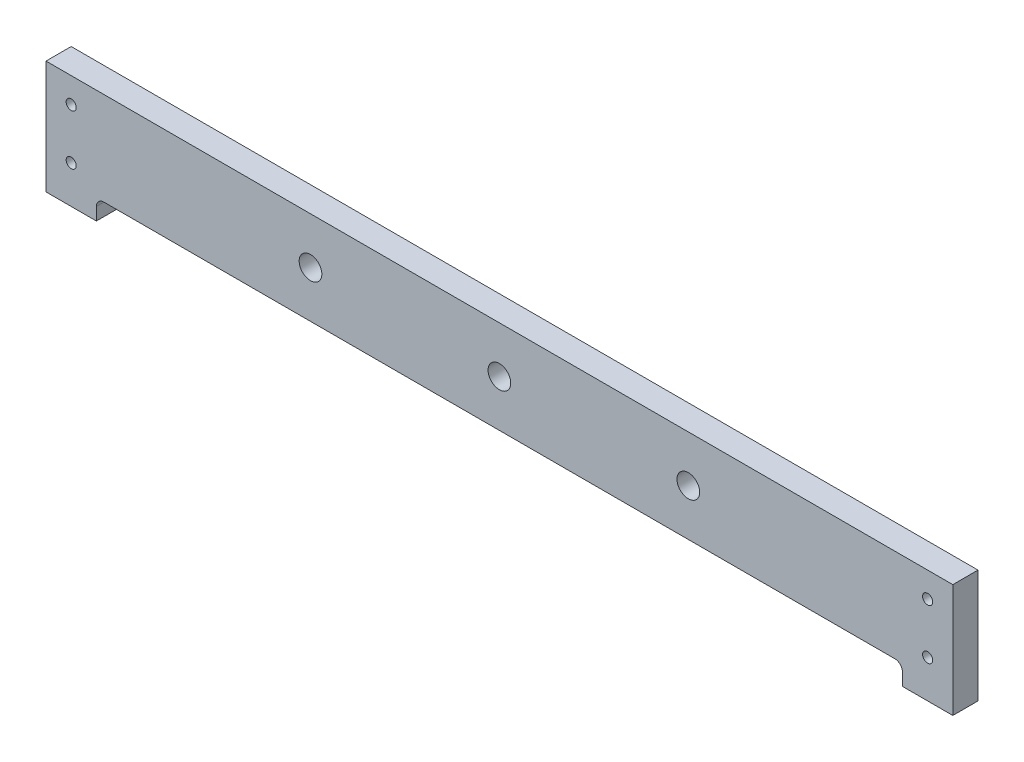
ISO-10303-21;
HEADER;
FILE_DESCRIPTION(('STEP AP214'),'2;1');
FILE_NAME('part.step','',(''),(''),'','','');
FILE_SCHEMA(('AUTOMOTIVE_DESIGN { 1 0 10303 214 1 1 1 1 }'));
ENDSEC;
DATA;
#1=APPLICATION_CONTEXT('core data for automotive mechanical design processes');
#2=APPLICATION_PROTOCOL_DEFINITION('international standard','automotive_design',2000,#1);
#3=PRODUCT_CONTEXT('',#1,'mechanical');
#4=PRODUCT('Part','Part','',(#3));
#5=PRODUCT_RELATED_PRODUCT_CATEGORY('part','',(#4));
#6=PRODUCT_DEFINITION_FORMATION('','',#4);
#7=PRODUCT_DEFINITION_CONTEXT('part definition',#1,'design');
#8=PRODUCT_DEFINITION('design','',#6,#7);
#9=PRODUCT_DEFINITION_SHAPE('','',#8);
#10=(LENGTH_UNIT() NAMED_UNIT(*) SI_UNIT(.MILLI.,.METRE.));
#11=(NAMED_UNIT(*) PLANE_ANGLE_UNIT() SI_UNIT($,.RADIAN.));
#12=(NAMED_UNIT(*) SI_UNIT($,.STERADIAN.) SOLID_ANGLE_UNIT());
#13=UNCERTAINTY_MEASURE_WITH_UNIT(LENGTH_MEASURE(1.E-05),#10,'distance_accuracy_value','');
#14=(GEOMETRIC_REPRESENTATION_CONTEXT(3) GLOBAL_UNCERTAINTY_ASSIGNED_CONTEXT((#13)) GLOBAL_UNIT_ASSIGNED_CONTEXT((#10,
#11,#12)) REPRESENTATION_CONTEXT('',''));
#15=CARTESIAN_POINT('',(0.,0.,0.));
#16=DIRECTION('',(0.,0.,1.));
#17=DIRECTION('',(1.,0.,0.));
#18=AXIS2_PLACEMENT_3D('',#15,#16,#17);
#19=CARTESIAN_POINT('',(23.,-40.,10.));
#20=DIRECTION('',(0.,0.,1.));
#21=DIRECTION('',(1.,0.,0.));
#22=AXIS2_PLACEMENT_3D('',#19,#20,#21);
#23=PLANE('',#22);
#24=CARTESIAN_POINT('',(255.,-18.5,10.));
#25=DIRECTION('',(0.,0.,1.));
#26=DIRECTION('',(1.,0.,0.));
#27=AXIS2_PLACEMENT_3D('',#24,#25,#26);
#28=CIRCLE('',#27,4.50000000000002);
#29=CARTESIAN_POINT('',(259.5,-18.5,10.));
#30=VERTEX_POINT('',#29);
#31=EDGE_CURVE('E281',#30,#30,#28,.T.);
#32=ORIENTED_EDGE('',*,*,#31,.F.);
#33=EDGE_LOOP('',(#32));
#34=FACE_BOUND('',#33,.T.);
#35=CARTESIAN_POINT('',(10.,-30.0044761270958,10.));
#36=DIRECTION('',(0.,0.,1.));
#37=DIRECTION('',(1.,0.,0.));
#38=AXIS2_PLACEMENT_3D('',#35,#36,#37);
#39=CIRCLE('',#38,2.);
#40=CARTESIAN_POINT('',(12.,-30.0044761270958,10.));
#41=VERTEX_POINT('',#40);
#42=EDGE_CURVE('E265',#41,#41,#39,.T.);
#43=ORIENTED_EDGE('',*,*,#42,.F.);
#44=EDGE_LOOP('',(#43));
#45=FACE_BOUND('',#44,.T.);
#46=CARTESIAN_POINT('',(350.,-30.,10.));
#47=DIRECTION('',(0.,0.,1.));
#48=DIRECTION('',(1.,0.,0.));
#49=AXIS2_PLACEMENT_3D('',#46,#47,#48);
#50=CIRCLE('',#49,2.);
#51=CARTESIAN_POINT('',(352.,-30.,10.));
#52=VERTEX_POINT('',#51);
#53=EDGE_CURVE('E249',#52,#52,#50,.T.);
#54=ORIENTED_EDGE('',*,*,#53,.F.);
#55=EDGE_LOOP('',(#54));
#56=FACE_BOUND('',#55,.T.);
#57=DIRECTION('',(0.,-1.,0.));
#58=VECTOR('',#57,1.);
#59=CARTESIAN_POINT('',(0.,0.,10.));
#60=LINE('',#59,#58);
#61=CARTESIAN_POINT('',(0.,0.,10.));
#62=VERTEX_POINT('',#61);
#63=CARTESIAN_POINT('',(0.,-45.,10.));
#64=VERTEX_POINT('',#63);
#65=EDGE_CURVE('E182',#62,#64,#60,.T.);
#66=ORIENTED_EDGE('',*,*,#65,.T.);
#67=DIRECTION('',(1.,0.,0.));
#68=VECTOR('',#67,1.);
#69=CARTESIAN_POINT('',(0.,-45.,10.));
#70=LINE('',#69,#68);
#71=CARTESIAN_POINT('',(20.,-45.,10.));
#72=VERTEX_POINT('',#71);
#73=EDGE_CURVE('E106',#64,#72,#70,.T.);
#74=ORIENTED_EDGE('',*,*,#73,.T.);
#75=DIRECTION('',(0.,1.,0.));
#76=VECTOR('',#75,1.);
#77=CARTESIAN_POINT('',(20.,-45.,10.));
#78=LINE('',#77,#76);
#79=CARTESIAN_POINT('',(20.,-40.,10.));
#80=VERTEX_POINT('',#79);
#81=EDGE_CURVE('E211',#72,#80,#78,.T.);
#82=ORIENTED_EDGE('',*,*,#81,.T.);
#83=CARTESIAN_POINT('',(23.,-40.,10.));
#84=DIRECTION('',(0.,0.,-1.));
#85=DIRECTION('',(1.,0.,0.));
#86=AXIS2_PLACEMENT_3D('',#83,#84,#85);
#87=CIRCLE('',#86,3.);
#88=CARTESIAN_POINT('',(23.,-37.,10.));
#89=VERTEX_POINT('',#88);
#90=EDGE_CURVE('E231',#80,#89,#87,.T.);
#91=ORIENTED_EDGE('',*,*,#90,.T.);
#92=DIRECTION('',(1.,0.,0.));
#93=VECTOR('',#92,1.);
#94=CARTESIAN_POINT('',(23.,-37.,10.));
#95=LINE('',#94,#93);
#96=CARTESIAN_POINT('',(337.,-37.,10.));
#97=VERTEX_POINT('',#96);
#98=EDGE_CURVE('E227',#89,#97,#95,.T.);
#99=ORIENTED_EDGE('',*,*,#98,.T.);
#100=CARTESIAN_POINT('',(337.,-40.,10.));
#101=DIRECTION('',(0.,0.,-1.));
#102=DIRECTION('',(1.,0.,0.));
#103=AXIS2_PLACEMENT_3D('',#100,#101,#102);
#104=CIRCLE('',#103,3.);
#105=CARTESIAN_POINT('',(340.,-40.,10.));
#106=VERTEX_POINT('',#105);
#107=EDGE_CURVE('E230',#97,#106,#104,.T.);
#108=ORIENTED_EDGE('',*,*,#107,.T.);
#109=DIRECTION('',(0.,-1.,0.));
#110=VECTOR('',#109,1.);
#111=CARTESIAN_POINT('',(340.,-45.,10.));
#112=LINE('',#111,#110);
#113=CARTESIAN_POINT('',(340.,-45.,10.));
#114=VERTEX_POINT('',#113);
#115=EDGE_CURVE('E131',#106,#114,#112,.T.);
#116=ORIENTED_EDGE('',*,*,#115,.T.);
#117=DIRECTION('',(1.,0.,0.));
#118=VECTOR('',#117,1.);
#119=CARTESIAN_POINT('',(360.,-45.,10.));
#120=LINE('',#119,#118);
#121=CARTESIAN_POINT('',(360.,-45.,10.));
#122=VERTEX_POINT('',#121);
#123=EDGE_CURVE('E125',#114,#122,#120,.T.);
#124=ORIENTED_EDGE('',*,*,#123,.T.);
#125=DIRECTION('',(0.,1.,0.));
#126=VECTOR('',#125,1.);
#127=CARTESIAN_POINT('',(360.,0.,10.));
#128=LINE('',#127,#126);
#129=CARTESIAN_POINT('',(360.,0.,10.));
#130=VERTEX_POINT('',#129);
#131=EDGE_CURVE('E129',#122,#130,#128,.T.);
#132=ORIENTED_EDGE('',*,*,#131,.T.);
#133=DIRECTION('',(-1.,0.,0.));
#134=VECTOR('',#133,1.);
#135=CARTESIAN_POINT('',(0.,0.,10.));
#136=LINE('',#135,#134);
#137=EDGE_CURVE('E57',#130,#62,#136,.T.);
#138=ORIENTED_EDGE('',*,*,#137,.T.);
#139=EDGE_LOOP('',(#66,#74,#82,#91,#99,#108,#116,#124,#132,#138));
#140=FACE_BOUND('',#139,.T.);
#141=CARTESIAN_POINT('',(350.,-10.,10.));
#142=DIRECTION('',(0.,0.,1.));
#143=DIRECTION('',(1.,0.,0.));
#144=AXIS2_PLACEMENT_3D('',#141,#142,#143);
#145=CIRCLE('',#144,2.);
#146=CARTESIAN_POINT('',(352.,-10.,10.));
#147=VERTEX_POINT('',#146);
#148=EDGE_CURVE('E158',#147,#147,#145,.T.);
#149=ORIENTED_EDGE('',*,*,#148,.F.);
#150=EDGE_LOOP('',(#149));
#151=FACE_BOUND('',#150,.T.);
#152=CARTESIAN_POINT('',(10.,-10.,10.));
#153=DIRECTION('',(0.,0.,1.));
#154=DIRECTION('',(1.,0.,0.));
#155=AXIS2_PLACEMENT_3D('',#152,#153,#154);
#156=CIRCLE('',#155,2.);
#157=CARTESIAN_POINT('',(12.,-10.,10.));
#158=VERTEX_POINT('',#157);
#159=EDGE_CURVE('E257',#158,#158,#156,.T.);
#160=ORIENTED_EDGE('',*,*,#159,.F.);
#161=EDGE_LOOP('',(#160));
#162=FACE_BOUND('',#161,.T.);
#163=CARTESIAN_POINT('',(180.,-18.5,10.));
#164=DIRECTION('',(0.,0.,1.));
#165=DIRECTION('',(1.,0.,0.));
#166=AXIS2_PLACEMENT_3D('',#163,#164,#165);
#167=CIRCLE('',#166,4.49999999999999);
#168=CARTESIAN_POINT('',(184.5,-18.5,10.));
#169=VERTEX_POINT('',#168);
#170=EDGE_CURVE('E273',#169,#169,#167,.T.);
#171=ORIENTED_EDGE('',*,*,#170,.F.);
#172=EDGE_LOOP('',(#171));
#173=FACE_BOUND('',#172,.T.);
#174=CARTESIAN_POINT('',(105.,-18.5,10.));
#175=DIRECTION('',(0.,0.,1.));
#176=DIRECTION('',(1.,0.,0.));
#177=AXIS2_PLACEMENT_3D('',#174,#175,#176);
#178=CIRCLE('',#177,4.5);
#179=CARTESIAN_POINT('',(109.5,-18.5,10.));
#180=VERTEX_POINT('',#179);
#181=EDGE_CURVE('E289',#180,#180,#178,.T.);
#182=ORIENTED_EDGE('',*,*,#181,.F.);
#183=EDGE_LOOP('',(#182));
#184=FACE_BOUND('',#183,.T.);
#185=ADVANCED_FACE('F39',(#34,#45,#56,#140,#151,#162,#173,#184),#23,.T.);
#186=CARTESIAN_POINT('',(23.,-40.,0.));
#187=DIRECTION('',(0.,0.,1.));
#188=DIRECTION('',(1.,0.,0.));
#189=AXIS2_PLACEMENT_3D('',#186,#187,#188);
#190=PLANE('',#189);
#191=DIRECTION('',(0.,-1.,0.));
#192=VECTOR('',#191,1.);
#193=CARTESIAN_POINT('',(0.,0.,0.));
#194=LINE('',#193,#192);
#195=CARTESIAN_POINT('',(0.,0.,0.));
#196=VERTEX_POINT('',#195);
#197=CARTESIAN_POINT('',(0.,-45.,0.));
#198=VERTEX_POINT('',#197);
#199=EDGE_CURVE('E153',#196,#198,#194,.T.);
#200=ORIENTED_EDGE('',*,*,#199,.F.);
#201=DIRECTION('',(-1.,0.,0.));
#202=VECTOR('',#201,1.);
#203=CARTESIAN_POINT('',(0.,0.,0.));
#204=LINE('',#203,#202);
#205=CARTESIAN_POINT('',(360.,0.,0.));
#206=VERTEX_POINT('',#205);
#207=EDGE_CURVE('E98',#206,#196,#204,.T.);
#208=ORIENTED_EDGE('',*,*,#207,.F.);
#209=DIRECTION('',(0.,1.,0.));
#210=VECTOR('',#209,1.);
#211=CARTESIAN_POINT('',(360.,0.,0.));
#212=LINE('',#211,#210);
#213=CARTESIAN_POINT('',(360.,-45.,0.));
#214=VERTEX_POINT('',#213);
#215=EDGE_CURVE('E92',#214,#206,#212,.T.);
#216=ORIENTED_EDGE('',*,*,#215,.F.);
#217=DIRECTION('',(1.,0.,0.));
#218=VECTOR('',#217,1.);
#219=CARTESIAN_POINT('',(360.,-45.,0.));
#220=LINE('',#219,#218);
#221=CARTESIAN_POINT('',(340.,-45.,0.));
#222=VERTEX_POINT('',#221);
#223=EDGE_CURVE('E140',#222,#214,#220,.T.);
#224=ORIENTED_EDGE('',*,*,#223,.F.);
#225=DIRECTION('',(0.,-1.,0.));
#226=VECTOR('',#225,1.);
#227=CARTESIAN_POINT('',(340.,-45.,0.));
#228=LINE('',#227,#226);
#229=CARTESIAN_POINT('',(340.,-40.,0.));
#230=VERTEX_POINT('',#229);
#231=EDGE_CURVE('E173',#230,#222,#228,.T.);
#232=ORIENTED_EDGE('',*,*,#231,.F.);
#233=CARTESIAN_POINT('',(337.,-40.,0.));
#234=DIRECTION('',(0.,0.,-1.));
#235=DIRECTION('',(1.,0.,0.));
#236=AXIS2_PLACEMENT_3D('',#233,#234,#235);
#237=CIRCLE('',#236,3.);
#238=CARTESIAN_POINT('',(337.,-37.,0.));
#239=VERTEX_POINT('',#238);
#240=EDGE_CURVE('E170',#239,#230,#237,.T.);
#241=ORIENTED_EDGE('',*,*,#240,.F.);
#242=DIRECTION('',(1.,0.,0.));
#243=VECTOR('',#242,1.);
#244=CARTESIAN_POINT('',(23.,-37.,0.));
#245=LINE('',#244,#243);
#246=CARTESIAN_POINT('',(23.,-37.,0.));
#247=VERTEX_POINT('',#246);
#248=EDGE_CURVE('E167',#247,#239,#245,.T.);
#249=ORIENTED_EDGE('',*,*,#248,.F.);
#250=CARTESIAN_POINT('',(23.,-40.,0.));
#251=DIRECTION('',(0.,0.,-1.));
#252=DIRECTION('',(1.,0.,0.));
#253=AXIS2_PLACEMENT_3D('',#250,#251,#252);
#254=CIRCLE('',#253,3.);
#255=CARTESIAN_POINT('',(20.,-40.,0.));
#256=VERTEX_POINT('',#255);
#257=EDGE_CURVE('E164',#256,#247,#254,.T.);
#258=ORIENTED_EDGE('',*,*,#257,.F.);
#259=DIRECTION('',(0.,1.,0.));
#260=VECTOR('',#259,1.);
#261=CARTESIAN_POINT('',(20.,-45.,0.));
#262=LINE('',#261,#260);
#263=CARTESIAN_POINT('',(20.,-45.,0.));
#264=VERTEX_POINT('',#263);
#265=EDGE_CURVE('E161',#264,#256,#262,.T.);
#266=ORIENTED_EDGE('',*,*,#265,.F.);
#267=DIRECTION('',(1.,0.,0.));
#268=VECTOR('',#267,1.);
#269=CARTESIAN_POINT('',(0.,-45.,0.));
#270=LINE('',#269,#268);
#271=EDGE_CURVE('E157',#198,#264,#270,.T.);
#272=ORIENTED_EDGE('',*,*,#271,.F.);
#273=EDGE_LOOP('',(#200,#208,#216,#224,#232,#241,#249,#258,#266,#272));
#274=FACE_BOUND('',#273,.T.);
#275=CARTESIAN_POINT('',(350.,-10.,0.));
#276=DIRECTION('',(0.,0.,1.));
#277=DIRECTION('',(1.,0.,0.));
#278=AXIS2_PLACEMENT_3D('',#275,#276,#277);
#279=CIRCLE('',#278,2.);
#280=CARTESIAN_POINT('',(352.,-10.,0.));
#281=VERTEX_POINT('',#280);
#282=EDGE_CURVE('E245',#281,#281,#279,.T.);
#283=ORIENTED_EDGE('',*,*,#282,.T.);
#284=EDGE_LOOP('',(#283));
#285=FACE_BOUND('',#284,.T.);
#286=CARTESIAN_POINT('',(350.,-30.,0.));
#287=DIRECTION('',(0.,0.,1.));
#288=DIRECTION('',(1.,0.,0.));
#289=AXIS2_PLACEMENT_3D('',#286,#287,#288);
#290=CIRCLE('',#289,2.);
#291=CARTESIAN_POINT('',(352.,-30.,0.));
#292=VERTEX_POINT('',#291);
#293=EDGE_CURVE('E253',#292,#292,#290,.T.);
#294=ORIENTED_EDGE('',*,*,#293,.T.);
#295=EDGE_LOOP('',(#294));
#296=FACE_BOUND('',#295,.T.);
#297=CARTESIAN_POINT('',(10.,-10.,0.));
#298=DIRECTION('',(0.,0.,1.));
#299=DIRECTION('',(1.,0.,0.));
#300=AXIS2_PLACEMENT_3D('',#297,#298,#299);
#301=CIRCLE('',#300,2.);
#302=CARTESIAN_POINT('',(12.,-10.,0.));
#303=VERTEX_POINT('',#302);
#304=EDGE_CURVE('E261',#303,#303,#301,.T.);
#305=ORIENTED_EDGE('',*,*,#304,.T.);
#306=EDGE_LOOP('',(#305));
#307=FACE_BOUND('',#306,.T.);
#308=CARTESIAN_POINT('',(10.,-30.0044761270958,0.));
#309=DIRECTION('',(0.,0.,1.));
#310=DIRECTION('',(1.,0.,0.));
#311=AXIS2_PLACEMENT_3D('',#308,#309,#310);
#312=CIRCLE('',#311,2.);
#313=CARTESIAN_POINT('',(12.,-30.0044761270958,0.));
#314=VERTEX_POINT('',#313);
#315=EDGE_CURVE('E269',#314,#314,#312,.T.);
#316=ORIENTED_EDGE('',*,*,#315,.T.);
#317=EDGE_LOOP('',(#316));
#318=FACE_BOUND('',#317,.T.);
#319=CARTESIAN_POINT('',(180.,-18.5,0.));
#320=DIRECTION('',(0.,0.,1.));
#321=DIRECTION('',(1.,0.,0.));
#322=AXIS2_PLACEMENT_3D('',#319,#320,#321);
#323=CIRCLE('',#322,4.49999999999999);
#324=CARTESIAN_POINT('',(184.5,-18.5,0.));
#325=VERTEX_POINT('',#324);
#326=EDGE_CURVE('E277',#325,#325,#323,.T.);
#327=ORIENTED_EDGE('',*,*,#326,.T.);
#328=EDGE_LOOP('',(#327));
#329=FACE_BOUND('',#328,.T.);
#330=CARTESIAN_POINT('',(255.,-18.5,0.));
#331=DIRECTION('',(0.,0.,1.));
#332=DIRECTION('',(1.,0.,0.));
#333=AXIS2_PLACEMENT_3D('',#330,#331,#332);
#334=CIRCLE('',#333,4.50000000000002);
#335=CARTESIAN_POINT('',(259.5,-18.5,0.));
#336=VERTEX_POINT('',#335);
#337=EDGE_CURVE('E285',#336,#336,#334,.T.);
#338=ORIENTED_EDGE('',*,*,#337,.T.);
#339=EDGE_LOOP('',(#338));
#340=FACE_BOUND('',#339,.T.);
#341=CARTESIAN_POINT('',(105.,-18.5,0.));
#342=DIRECTION('',(0.,0.,1.));
#343=DIRECTION('',(1.,0.,0.));
#344=AXIS2_PLACEMENT_3D('',#341,#342,#343);
#345=CIRCLE('',#344,4.5);
#346=CARTESIAN_POINT('',(109.5,-18.5,0.));
#347=VERTEX_POINT('',#346);
#348=EDGE_CURVE('E293',#347,#347,#345,.T.);
#349=ORIENTED_EDGE('',*,*,#348,.T.);
#350=EDGE_LOOP('',(#349));
#351=FACE_BOUND('',#350,.T.);
#352=ADVANCED_FACE('F215',(#274,#285,#296,#307,#318,#329,#340,#351),#190,.F.);
#353=CARTESIAN_POINT('',(0.,0.,10.));
#354=DIRECTION('',(1.,0.,0.));
#355=DIRECTION('',(0.,1.,0.));
#356=AXIS2_PLACEMENT_3D('',#353,#354,#355);
#357=PLANE('',#356);
#358=ORIENTED_EDGE('',*,*,#199,.T.);
#359=DIRECTION('',(0.,0.,-1.));
#360=VECTOR('',#359,1.);
#361=CARTESIAN_POINT('',(0.,-45.,10.));
#362=LINE('',#361,#360);
#363=EDGE_CURVE('E11',#64,#198,#362,.T.);
#364=ORIENTED_EDGE('',*,*,#363,.F.);
#365=ORIENTED_EDGE('',*,*,#65,.F.);
#366=DIRECTION('',(0.,0.,-1.));
#367=VECTOR('',#366,1.);
#368=CARTESIAN_POINT('',(0.,0.,10.));
#369=LINE('',#368,#367);
#370=EDGE_CURVE('E149',#62,#196,#369,.T.);
#371=ORIENTED_EDGE('',*,*,#370,.T.);
#372=EDGE_LOOP('',(#358,#364,#365,#371));
#373=FACE_BOUND('',#372,.T.);
#374=ADVANCED_FACE('F41',(#373),#357,.F.);
#375=CARTESIAN_POINT('',(0.,-45.,10.));
#376=DIRECTION('',(0.,1.,0.));
#377=DIRECTION('',(0.,0.,1.));
#378=AXIS2_PLACEMENT_3D('',#375,#376,#377);
#379=PLANE('',#378);
#380=ORIENTED_EDGE('',*,*,#271,.T.);
#381=DIRECTION('',(0.,0.,-1.));
#382=VECTOR('',#381,1.);
#383=CARTESIAN_POINT('',(20.,-45.,10.));
#384=LINE('',#383,#382);
#385=EDGE_CURVE('E49',#72,#264,#384,.T.);
#386=ORIENTED_EDGE('',*,*,#385,.F.);
#387=ORIENTED_EDGE('',*,*,#73,.F.);
#388=ORIENTED_EDGE('',*,*,#363,.T.);
#389=EDGE_LOOP('',(#380,#386,#387,#388));
#390=FACE_BOUND('',#389,.T.);
#391=ADVANCED_FACE('F337',(#390),#379,.F.);
#392=CARTESIAN_POINT('',(20.,-45.,10.));
#393=DIRECTION('',(-1.,0.,0.));
#394=DIRECTION('',(0.,0.,1.));
#395=AXIS2_PLACEMENT_3D('',#392,#393,#394);
#396=PLANE('',#395);
#397=ORIENTED_EDGE('',*,*,#265,.T.);
#398=DIRECTION('',(0.,0.,-1.));
#399=VECTOR('',#398,1.);
#400=CARTESIAN_POINT('',(20.,-40.,10.));
#401=LINE('',#400,#399);
#402=EDGE_CURVE('E201',#80,#256,#401,.T.);
#403=ORIENTED_EDGE('',*,*,#402,.F.);
#404=ORIENTED_EDGE('',*,*,#81,.F.);
#405=ORIENTED_EDGE('',*,*,#385,.T.);
#406=EDGE_LOOP('',(#397,#403,#404,#405));
#407=FACE_BOUND('',#406,.T.);
#408=ADVANCED_FACE('F209',(#407),#396,.F.);
#409=CARTESIAN_POINT('',(23.,-40.,10.));
#410=DIRECTION('',(0.,0.,-1.));
#411=DIRECTION('',(-1.,0.,0.));
#412=AXIS2_PLACEMENT_3D('',#409,#410,#411);
#413=CYLINDRICAL_SURFACE('',#412,3.);
#414=ORIENTED_EDGE('',*,*,#257,.T.);
#415=DIRECTION('',(0.,0.,-1.));
#416=VECTOR('',#415,1.);
#417=CARTESIAN_POINT('',(23.,-37.,10.));
#418=LINE('',#417,#416);
#419=EDGE_CURVE('E197',#89,#247,#418,.T.);
#420=ORIENTED_EDGE('',*,*,#419,.F.);
#421=ORIENTED_EDGE('',*,*,#90,.F.);
#422=ORIENTED_EDGE('',*,*,#402,.T.);
#423=EDGE_LOOP('',(#414,#420,#421,#422));
#424=FACE_BOUND('',#423,.T.);
#425=ADVANCED_FACE('F221',(#424),#413,.F.);
#426=CARTESIAN_POINT('',(23.,-37.,10.));
#427=DIRECTION('',(0.,1.,0.));
#428=DIRECTION('',(0.,0.,1.));
#429=AXIS2_PLACEMENT_3D('',#426,#427,#428);
#430=PLANE('',#429);
#431=ORIENTED_EDGE('',*,*,#248,.T.);
#432=DIRECTION('',(0.,0.,-1.));
#433=VECTOR('',#432,1.);
#434=CARTESIAN_POINT('',(337.,-37.,10.));
#435=LINE('',#434,#433);
#436=EDGE_CURVE('E193',#97,#239,#435,.T.);
#437=ORIENTED_EDGE('',*,*,#436,.F.);
#438=ORIENTED_EDGE('',*,*,#98,.F.);
#439=ORIENTED_EDGE('',*,*,#419,.T.);
#440=EDGE_LOOP('',(#431,#437,#438,#439));
#441=FACE_BOUND('',#440,.T.);
#442=ADVANCED_FACE('F225',(#441),#430,.F.);
#443=CARTESIAN_POINT('',(337.,-40.,10.));
#444=DIRECTION('',(0.,0.,-1.));
#445=DIRECTION('',(-1.,0.,0.));
#446=AXIS2_PLACEMENT_3D('',#443,#444,#445);
#447=CYLINDRICAL_SURFACE('',#446,3.);
#448=ORIENTED_EDGE('',*,*,#240,.T.);
#449=DIRECTION('',(0.,0.,-1.));
#450=VECTOR('',#449,1.);
#451=CARTESIAN_POINT('',(340.,-40.,10.));
#452=LINE('',#451,#450);
#453=EDGE_CURVE('E189',#106,#230,#452,.T.);
#454=ORIENTED_EDGE('',*,*,#453,.F.);
#455=ORIENTED_EDGE('',*,*,#107,.F.);
#456=ORIENTED_EDGE('',*,*,#436,.T.);
#457=EDGE_LOOP('',(#448,#454,#455,#456));
#458=FACE_BOUND('',#457,.T.);
#459=ADVANCED_FACE('F327',(#458),#447,.F.);
#460=CARTESIAN_POINT('',(340.,-45.,10.));
#461=DIRECTION('',(1.,0.,0.));
#462=DIRECTION('',(0.,0.,-1.));
#463=AXIS2_PLACEMENT_3D('',#460,#461,#462);
#464=PLANE('',#463);
#465=ORIENTED_EDGE('',*,*,#231,.T.);
#466=DIRECTION('',(0.,0.,-1.));
#467=VECTOR('',#466,1.);
#468=CARTESIAN_POINT('',(340.,-45.,10.));
#469=LINE('',#468,#467);
#470=EDGE_CURVE('E142',#114,#222,#469,.T.);
#471=ORIENTED_EDGE('',*,*,#470,.F.);
#472=ORIENTED_EDGE('',*,*,#115,.F.);
#473=ORIENTED_EDGE('',*,*,#453,.T.);
#474=EDGE_LOOP('',(#465,#471,#472,#473));
#475=FACE_BOUND('',#474,.T.);
#476=ADVANCED_FACE('F324',(#475),#464,.F.);
#477=CARTESIAN_POINT('',(360.,-45.,10.));
#478=DIRECTION('',(0.,1.,0.));
#479=DIRECTION('',(-1.,0.,0.));
#480=AXIS2_PLACEMENT_3D('',#477,#478,#479);
#481=PLANE('',#480);
#482=ORIENTED_EDGE('',*,*,#223,.T.);
#483=DIRECTION('',(0.,0.,-1.));
#484=VECTOR('',#483,1.);
#485=CARTESIAN_POINT('',(360.,-45.,10.));
#486=LINE('',#485,#484);
#487=EDGE_CURVE('E137',#122,#214,#486,.T.);
#488=ORIENTED_EDGE('',*,*,#487,.F.);
#489=ORIENTED_EDGE('',*,*,#123,.F.);
#490=ORIENTED_EDGE('',*,*,#470,.T.);
#491=EDGE_LOOP('',(#482,#488,#489,#490));
#492=FACE_BOUND('',#491,.T.);
#493=ADVANCED_FACE('F138',(#492),#481,.F.);
#494=CARTESIAN_POINT('',(360.,0.,10.));
#495=DIRECTION('',(-1.,0.,0.));
#496=DIRECTION('',(0.,0.,1.));
#497=AXIS2_PLACEMENT_3D('',#494,#495,#496);
#498=PLANE('',#497);
#499=ORIENTED_EDGE('',*,*,#215,.T.);
#500=DIRECTION('',(0.,0.,-1.));
#501=VECTOR('',#500,1.);
#502=CARTESIAN_POINT('',(360.,0.,10.));
#503=LINE('',#502,#501);
#504=EDGE_CURVE('E143',#130,#206,#503,.T.);
#505=ORIENTED_EDGE('',*,*,#504,.F.);
#506=ORIENTED_EDGE('',*,*,#131,.F.);
#507=ORIENTED_EDGE('',*,*,#487,.T.);
#508=EDGE_LOOP('',(#499,#505,#506,#507));
#509=FACE_BOUND('',#508,.T.);
#510=ADVANCED_FACE('F145',(#509),#498,.F.);
#511=CARTESIAN_POINT('',(0.,0.,10.));
#512=DIRECTION('',(0.,-1.,0.));
#513=DIRECTION('',(0.,0.,-1.));
#514=AXIS2_PLACEMENT_3D('',#511,#512,#513);
#515=PLANE('',#514);
#516=ORIENTED_EDGE('',*,*,#207,.T.);
#517=ORIENTED_EDGE('',*,*,#370,.F.);
#518=ORIENTED_EDGE('',*,*,#137,.F.);
#519=ORIENTED_EDGE('',*,*,#504,.T.);
#520=EDGE_LOOP('',(#516,#517,#518,#519));
#521=FACE_BOUND('',#520,.T.);
#522=ADVANCED_FACE('F317',(#521),#515,.F.);
#523=CARTESIAN_POINT('',(350.,-10.,10.));
#524=DIRECTION('',(0.,0.,-1.));
#525=DIRECTION('',(-1.,0.,0.));
#526=AXIS2_PLACEMENT_3D('',#523,#524,#525);
#527=CYLINDRICAL_SURFACE('',#526,2.);
#528=ORIENTED_EDGE('',*,*,#148,.T.);
#529=EDGE_LOOP('',(#528));
#530=FACE_BOUND('',#529,.T.);
#531=ORIENTED_EDGE('',*,*,#282,.F.);
#532=EDGE_LOOP('',(#531));
#533=FACE_BOUND('',#532,.T.);
#534=ADVANCED_FACE('F314',(#530,#533),#527,.F.);
#535=CARTESIAN_POINT('',(350.,-30.,10.));
#536=DIRECTION('',(0.,0.,-1.));
#537=DIRECTION('',(-1.,0.,0.));
#538=AXIS2_PLACEMENT_3D('',#535,#536,#537);
#539=CYLINDRICAL_SURFACE('',#538,2.);
#540=ORIENTED_EDGE('',*,*,#53,.T.);
#541=EDGE_LOOP('',(#540));
#542=FACE_BOUND('',#541,.T.);
#543=ORIENTED_EDGE('',*,*,#293,.F.);
#544=EDGE_LOOP('',(#543));
#545=FACE_BOUND('',#544,.T.);
#546=ADVANCED_FACE('F413',(#542,#545),#539,.F.);
#547=CARTESIAN_POINT('',(10.,-10.,10.));
#548=DIRECTION('',(0.,0.,-1.));
#549=DIRECTION('',(-1.,0.,0.));
#550=AXIS2_PLACEMENT_3D('',#547,#548,#549);
#551=CYLINDRICAL_SURFACE('',#550,2.);
#552=ORIENTED_EDGE('',*,*,#159,.T.);
#553=EDGE_LOOP('',(#552));
#554=FACE_BOUND('',#553,.T.);
#555=ORIENTED_EDGE('',*,*,#304,.F.);
#556=EDGE_LOOP('',(#555));
#557=FACE_BOUND('',#556,.T.);
#558=ADVANCED_FACE('F421',(#554,#557),#551,.F.);
#559=CARTESIAN_POINT('',(10.,-30.0044761270958,10.));
#560=DIRECTION('',(0.,0.,-1.));
#561=DIRECTION('',(-1.,0.,0.));
#562=AXIS2_PLACEMENT_3D('',#559,#560,#561);
#563=CYLINDRICAL_SURFACE('',#562,2.);
#564=ORIENTED_EDGE('',*,*,#42,.T.);
#565=EDGE_LOOP('',(#564));
#566=FACE_BOUND('',#565,.T.);
#567=ORIENTED_EDGE('',*,*,#315,.F.);
#568=EDGE_LOOP('',(#567));
#569=FACE_BOUND('',#568,.T.);
#570=ADVANCED_FACE('F429',(#566,#569),#563,.F.);
#571=CARTESIAN_POINT('',(180.,-18.5,10.));
#572=DIRECTION('',(0.,0.,-1.));
#573=DIRECTION('',(-1.,0.,0.));
#574=AXIS2_PLACEMENT_3D('',#571,#572,#573);
#575=CYLINDRICAL_SURFACE('',#574,4.49999999999999);
#576=ORIENTED_EDGE('',*,*,#170,.T.);
#577=EDGE_LOOP('',(#576));
#578=FACE_BOUND('',#577,.T.);
#579=ORIENTED_EDGE('',*,*,#326,.F.);
#580=EDGE_LOOP('',(#579));
#581=FACE_BOUND('',#580,.T.);
#582=ADVANCED_FACE('F438',(#578,#581),#575,.F.);
#583=CARTESIAN_POINT('',(255.,-18.5,10.));
#584=DIRECTION('',(0.,0.,-1.));
#585=DIRECTION('',(-1.,0.,0.));
#586=AXIS2_PLACEMENT_3D('',#583,#584,#585);
#587=CYLINDRICAL_SURFACE('',#586,4.50000000000002);
#588=ORIENTED_EDGE('',*,*,#31,.T.);
#589=EDGE_LOOP('',(#588));
#590=FACE_BOUND('',#589,.T.);
#591=ORIENTED_EDGE('',*,*,#337,.F.);
#592=EDGE_LOOP('',(#591));
#593=FACE_BOUND('',#592,.T.);
#594=ADVANCED_FACE('F447',(#590,#593),#587,.F.);
#595=CARTESIAN_POINT('',(105.,-18.5,10.));
#596=DIRECTION('',(0.,0.,-1.));
#597=DIRECTION('',(-1.,0.,0.));
#598=AXIS2_PLACEMENT_3D('',#595,#596,#597);
#599=CYLINDRICAL_SURFACE('',#598,4.5);
#600=ORIENTED_EDGE('',*,*,#181,.T.);
#601=EDGE_LOOP('',(#600));
#602=FACE_BOUND('',#601,.T.);
#603=ORIENTED_EDGE('',*,*,#348,.F.);
#604=EDGE_LOOP('',(#603));
#605=FACE_BOUND('',#604,.T.);
#606=ADVANCED_FACE('F301',(#602,#605),#599,.F.);
#607=CLOSED_SHELL('',(#185,#352,#374,#391,#408,#425,#442,#459,#476,#493,#510,#522,#534,#546,
#558,#570,#582,#594,#606));
#608=MANIFOLD_SOLID_BREP('B2',#607);
#609=ADVANCED_BREP_SHAPE_REPRESENTATION('',(#18,#608),#14);
#610=SHAPE_DEFINITION_REPRESENTATION(#9,#609);
ENDSEC;
END-ISO-10303-21;
